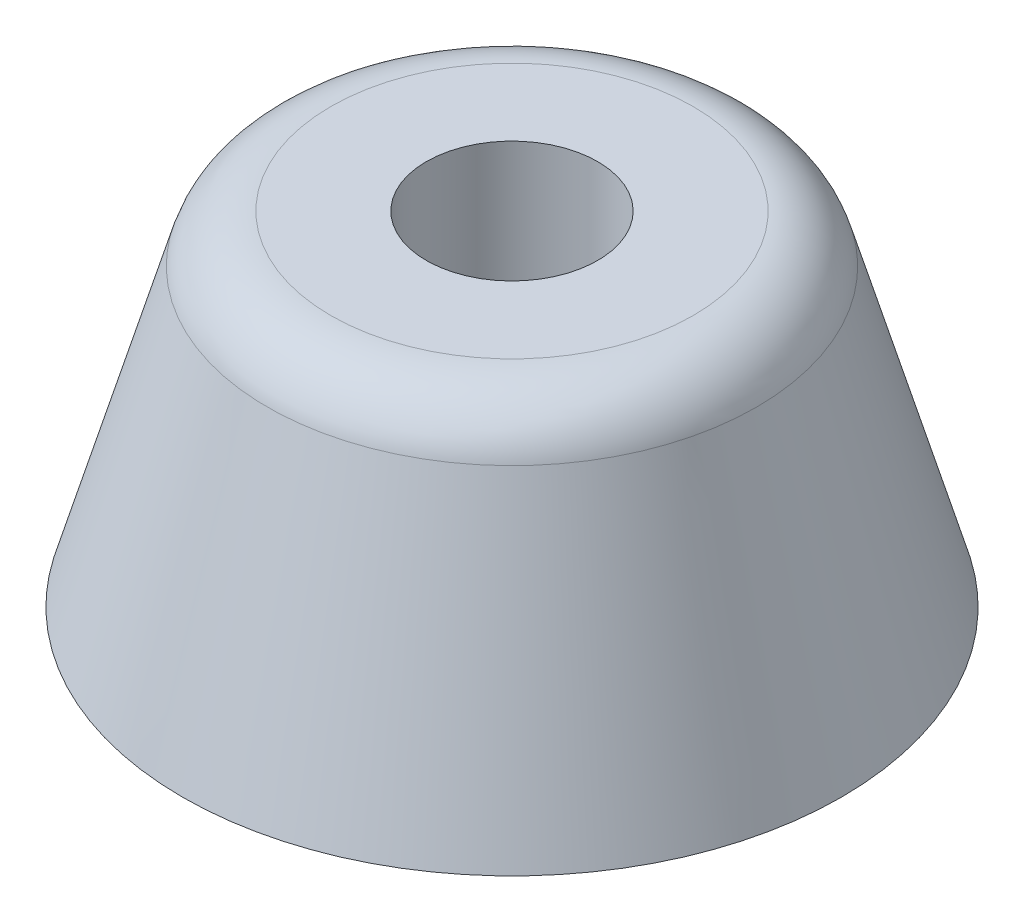
ISO-10303-21;
HEADER;
FILE_DESCRIPTION(('STEP AP214'),'2;1');
FILE_NAME('part.step','',(''),(''),'','','');
FILE_SCHEMA(('AUTOMOTIVE_DESIGN { 1 0 10303 214 1 1 1 1 }'));
ENDSEC;
DATA;
#1=APPLICATION_CONTEXT('core data for automotive mechanical design processes');
#2=APPLICATION_PROTOCOL_DEFINITION('international standard','automotive_design',2000,#1);
#3=PRODUCT_CONTEXT('',#1,'mechanical');
#4=PRODUCT('Part','Part','',(#3));
#5=PRODUCT_RELATED_PRODUCT_CATEGORY('part','',(#4));
#6=PRODUCT_DEFINITION_FORMATION('','',#4);
#7=PRODUCT_DEFINITION_CONTEXT('part definition',#1,'design');
#8=PRODUCT_DEFINITION('design','',#6,#7);
#9=PRODUCT_DEFINITION_SHAPE('','',#8);
#10=(LENGTH_UNIT() NAMED_UNIT(*) SI_UNIT(.MILLI.,.METRE.));
#11=(NAMED_UNIT(*) PLANE_ANGLE_UNIT() SI_UNIT($,.RADIAN.));
#12=(NAMED_UNIT(*) SI_UNIT($,.STERADIAN.) SOLID_ANGLE_UNIT());
#13=UNCERTAINTY_MEASURE_WITH_UNIT(LENGTH_MEASURE(1.E-05),#10,'distance_accuracy_value','');
#14=(GEOMETRIC_REPRESENTATION_CONTEXT(3) GLOBAL_UNCERTAINTY_ASSIGNED_CONTEXT((#13)) GLOBAL_UNIT_ASSIGNED_CONTEXT((#10,
#11,#12)) REPRESENTATION_CONTEXT('',''));
#15=CARTESIAN_POINT('',(0.,0.,0.));
#16=DIRECTION('',(0.,0.,1.));
#17=DIRECTION('',(1.,0.,0.));
#18=AXIS2_PLACEMENT_3D('',#15,#16,#17);
#19=CARTESIAN_POINT('',(0.,0.,0.));
#20=DIRECTION('',(0.,1.,0.));
#21=DIRECTION('',(0.,0.,1.));
#22=AXIS2_PLACEMENT_3D('',#19,#20,#21);
#23=PLANE('',#22);
#24=CARTESIAN_POINT('',(0.,0.,0.));
#25=DIRECTION('',(0.,1.,0.));
#26=DIRECTION('',(0.,0.,1.));
#27=AXIS2_PLACEMENT_3D('',#24,#25,#26);
#28=CIRCLE('',#27,4.);
#29=CARTESIAN_POINT('',(0.,0.,4.));
#30=VERTEX_POINT('',#29);
#31=EDGE_CURVE('E63',#30,#30,#28,.F.);
#32=ORIENTED_EDGE('',*,*,#31,.F.);
#33=EDGE_LOOP('',(#32));
#34=FACE_BOUND('',#33,.T.);
#35=CARTESIAN_POINT('',(0.,0.,0.));
#36=DIRECTION('',(0.,1.,0.));
#37=DIRECTION('',(0.,0.,1.));
#38=AXIS2_PLACEMENT_3D('',#35,#36,#37);
#39=CIRCLE('',#38,25.);
#40=CARTESIAN_POINT('',(0.,0.,25.));
#41=VERTEX_POINT('',#40);
#42=EDGE_CURVE('E49',#41,#41,#39,.T.);
#43=ORIENTED_EDGE('',*,*,#42,.F.);
#44=EDGE_LOOP('',(#43));
#45=FACE_BOUND('',#44,.T.);
#46=ADVANCED_FACE('F36',(#34,#45),#23,.F.);
#47=CARTESIAN_POINT('',(0.,26.,0.));
#48=DIRECTION('',(0.,-1.,0.));
#49=DIRECTION('',(1.,0.,0.));
#50=AXIS2_PLACEMENT_3D('',#47,#48,#49);
#51=PLANE('',#50);
#52=CARTESIAN_POINT('',(0.,26.,0.));
#53=DIRECTION('',(0.,-1.,0.));
#54=DIRECTION('',(1.,0.,0.));
#55=AXIS2_PLACEMENT_3D('',#52,#53,#54);
#56=CIRCLE('',#55,13.7384387970251);
#57=CARTESIAN_POINT('',(13.7384387970251,25.9999999999999,0.));
#58=VERTEX_POINT('',#57);
#59=EDGE_CURVE('E11',#58,#58,#56,.F.);
#60=ORIENTED_EDGE('',*,*,#59,.T.);
#61=EDGE_LOOP('',(#60));
#62=FACE_BOUND('',#61,.T.);
#63=CARTESIAN_POINT('',(1.81557029619843E-13,26.,0.));
#64=DIRECTION('',(0.,1.,0.));
#65=DIRECTION('',(-1.,0.,0.));
#66=AXIS2_PLACEMENT_3D('',#63,#64,#65);
#67=CIRCLE('',#66,6.5);
#68=CARTESIAN_POINT('',(-6.49999999999982,26.,0.));
#69=VERTEX_POINT('',#68);
#70=EDGE_CURVE('E58',#69,#69,#67,.T.);
#71=ORIENTED_EDGE('',*,*,#70,.F.);
#72=EDGE_LOOP('',(#71));
#73=FACE_BOUND('',#72,.T.);
#74=ADVANCED_FACE('F82',(#62,#73),#51,.F.);
#75=CARTESIAN_POINT('',(0.,26.,0.));
#76=DIRECTION('',(0.,-1.,0.));
#77=DIRECTION('',(1.,0.,0.));
#78=AXIS2_PLACEMENT_3D('',#75,#76,#77);
#79=CONICAL_SURFACE('',#78,17.5,0.280837724621203);
#80=CARTESIAN_POINT('',(0.,22.3858032565109,0.));
#81=DIRECTION('',(0.,-1.,0.));
#82=DIRECTION('',(1.,0.,0.));
#83=AXIS2_PLACEMENT_3D('',#80,#81,#82);
#84=CIRCLE('',#83,18.5425567529295);
#85=CARTESIAN_POINT('',(18.5425567529295,22.3858032565108,0.));
#86=VERTEX_POINT('',#85);
#87=EDGE_CURVE('E44',#86,#86,#84,.T.);
#88=ORIENTED_EDGE('',*,*,#87,.T.);
#89=EDGE_LOOP('',(#88));
#90=FACE_BOUND('',#89,.T.);
#91=ORIENTED_EDGE('',*,*,#42,.T.);
#92=EDGE_LOOP('',(#91));
#93=FACE_BOUND('',#92,.T.);
#94=ADVANCED_FACE('F72',(#90,#93),#79,.T.);
#95=CARTESIAN_POINT('',(1.04744440165294E-13,15.,0.));
#96=DIRECTION('',(0.,1.,0.));
#97=DIRECTION('',(-1.,0.,0.));
#98=AXIS2_PLACEMENT_3D('',#95,#96,#97);
#99=CYLINDRICAL_SURFACE('',#98,6.5);
#100=CARTESIAN_POINT('',(1.04744440165294E-13,15.,0.));
#101=DIRECTION('',(0.,1.,0.));
#102=DIRECTION('',(-1.,0.,0.));
#103=AXIS2_PLACEMENT_3D('',#100,#101,#102);
#104=CIRCLE('',#103,6.5);
#105=CARTESIAN_POINT('',(-6.4999999999999,15.,0.));
#106=VERTEX_POINT('',#105);
#107=EDGE_CURVE('E53',#106,#106,#104,.T.);
#108=ORIENTED_EDGE('',*,*,#107,.F.);
#109=EDGE_LOOP('',(#108));
#110=FACE_BOUND('',#109,.T.);
#111=ORIENTED_EDGE('',*,*,#70,.T.);
#112=EDGE_LOOP('',(#111));
#113=FACE_BOUND('',#112,.T.);
#114=ADVANCED_FACE('F81',(#110,#113),#99,.F.);
#115=CARTESIAN_POINT('',(1.04744440165294E-13,15.,0.));
#116=DIRECTION('',(0.,1.,0.));
#117=DIRECTION('',(-1.,0.,0.));
#118=AXIS2_PLACEMENT_3D('',#115,#116,#117);
#119=PLANE('',#118);
#120=CARTESIAN_POINT('',(1.04744440165294E-13,15.,0.));
#121=DIRECTION('',(0.,1.,0.));
#122=DIRECTION('',(-1.,0.,0.));
#123=AXIS2_PLACEMENT_3D('',#120,#121,#122);
#124=CIRCLE('',#123,4.);
#125=CARTESIAN_POINT('',(-3.9999999999999,15.,0.));
#126=VERTEX_POINT('',#125);
#127=EDGE_CURVE('E102',#126,#126,#124,.T.);
#128=ORIENTED_EDGE('',*,*,#127,.F.);
#129=EDGE_LOOP('',(#128));
#130=FACE_BOUND('',#129,.T.);
#131=ORIENTED_EDGE('',*,*,#107,.T.);
#132=EDGE_LOOP('',(#131));
#133=FACE_BOUND('',#132,.T.);
#134=ADVANCED_FACE('F108',(#130,#133),#119,.T.);
#135=CARTESIAN_POINT('',(0.,-0.00110000000034909,0.));
#136=DIRECTION('',(0.,1.,0.));
#137=DIRECTION('',(-1.,0.,0.));
#138=AXIS2_PLACEMENT_3D('',#135,#136,#137);
#139=CYLINDRICAL_SURFACE('',#138,4.);
#140=ORIENTED_EDGE('',*,*,#127,.T.);
#141=EDGE_LOOP('',(#140));
#142=FACE_BOUND('',#141,.T.);
#143=ORIENTED_EDGE('',*,*,#31,.T.);
#144=EDGE_LOOP('',(#143));
#145=FACE_BOUND('',#144,.T.);
#146=ADVANCED_FACE('F106',(#142,#145),#139,.F.);
#147=CARTESIAN_POINT('',(0.,21.,0.));
#148=DIRECTION('',(0.,-1.,0.));
#149=DIRECTION('',(1.,0.,0.));
#150=AXIS2_PLACEMENT_3D('',#147,#148,#149);
#151=TOROIDAL_SURFACE('',#150,13.7384387970251,5.);
#152=ORIENTED_EDGE('',*,*,#59,.F.);
#153=EDGE_LOOP('',(#152));
#154=FACE_BOUND('',#153,.T.);
#155=ORIENTED_EDGE('',*,*,#87,.F.);
#156=EDGE_LOOP('',(#155));
#157=FACE_BOUND('',#156,.T.);
#158=ADVANCED_FACE('F38',(#154,#157),#151,.T.);
#159=CLOSED_SHELL('',(#46,#74,#94,#114,#134,#146,#158));
#160=MANIFOLD_SOLID_BREP('B2',#159);
#161=ADVANCED_BREP_SHAPE_REPRESENTATION('',(#18,#160),#14);
#162=SHAPE_DEFINITION_REPRESENTATION(#9,#161);
ENDSEC;
END-ISO-10303-21;
